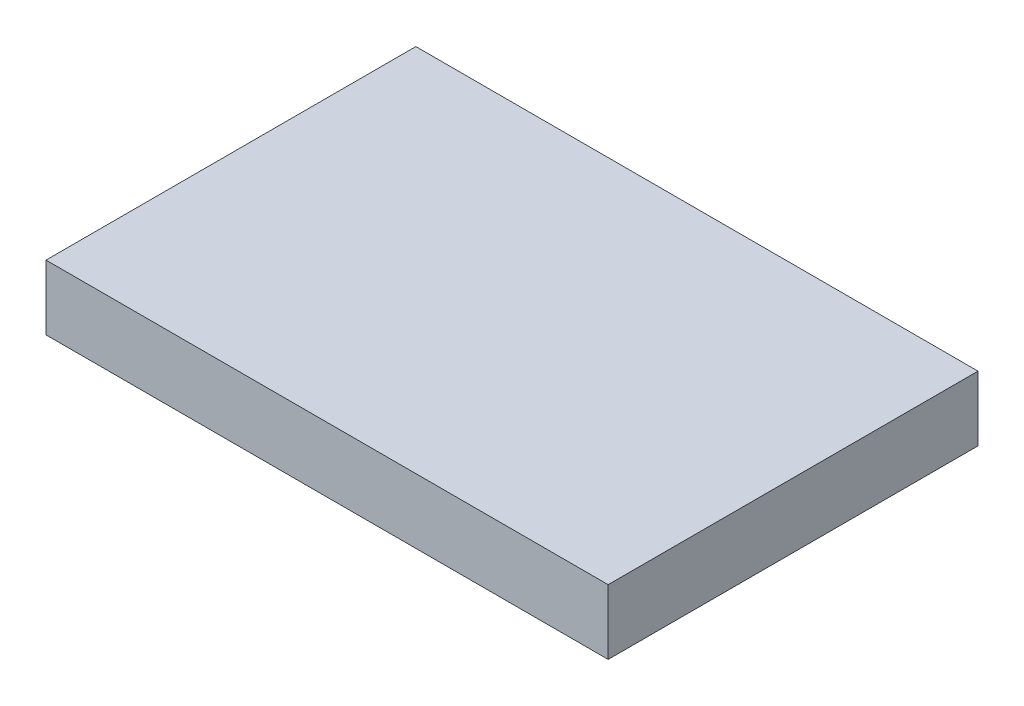
ISO-10303-21;
HEADER;
FILE_DESCRIPTION(('STEP AP214'),'2;1');
FILE_NAME('part.step','',(''),(''),'','','');
FILE_SCHEMA(('AUTOMOTIVE_DESIGN { 1 0 10303 214 1 1 1 1 }'));
ENDSEC;
DATA;
#1=APPLICATION_CONTEXT('core data for automotive mechanical design processes');
#2=APPLICATION_PROTOCOL_DEFINITION('international standard','automotive_design',2000,#1);
#3=PRODUCT_CONTEXT('',#1,'mechanical');
#4=PRODUCT('Part','Part','',(#3));
#5=PRODUCT_RELATED_PRODUCT_CATEGORY('part','',(#4));
#6=PRODUCT_DEFINITION_FORMATION('','',#4);
#7=PRODUCT_DEFINITION_CONTEXT('part definition',#1,'design');
#8=PRODUCT_DEFINITION('design','',#6,#7);
#9=PRODUCT_DEFINITION_SHAPE('','',#8);
#10=(LENGTH_UNIT() NAMED_UNIT(*) SI_UNIT(.MILLI.,.METRE.));
#11=(NAMED_UNIT(*) PLANE_ANGLE_UNIT() SI_UNIT($,.RADIAN.));
#12=(NAMED_UNIT(*) SI_UNIT($,.STERADIAN.) SOLID_ANGLE_UNIT());
#13=UNCERTAINTY_MEASURE_WITH_UNIT(LENGTH_MEASURE(1.E-05),#10,'distance_accuracy_value','');
#14=(GEOMETRIC_REPRESENTATION_CONTEXT(3) GLOBAL_UNCERTAINTY_ASSIGNED_CONTEXT((#13)) GLOBAL_UNIT_ASSIGNED_CONTEXT((#10,
#11,#12)) REPRESENTATION_CONTEXT('',''));
#15=CARTESIAN_POINT('',(0.,0.,0.));
#16=DIRECTION('',(0.,0.,1.));
#17=DIRECTION('',(1.,0.,0.));
#18=AXIS2_PLACEMENT_3D('',#15,#16,#17);
#19=CARTESIAN_POINT('',(0.,9.5,0.));
#20=DIRECTION('',(1.,0.,0.));
#21=DIRECTION('',(0.,0.,-1.));
#22=AXIS2_PLACEMENT_3D('',#19,#20,#21);
#23=PLANE('',#22);
#24=DIRECTION('',(0.,0.,1.));
#25=VECTOR('',#24,1.);
#26=CARTESIAN_POINT('',(0.,0.,0.));
#27=LINE('',#26,#25);
#28=CARTESIAN_POINT('',(0.,0.,0.));
#29=VERTEX_POINT('',#28);
#30=CARTESIAN_POINT('',(0.,0.,54.25));
#31=VERTEX_POINT('',#30);
#32=EDGE_CURVE('E100',#29,#31,#27,.T.);
#33=ORIENTED_EDGE('',*,*,#32,.T.);
#34=DIRECTION('',(0.,-1.,0.));
#35=VECTOR('',#34,1.);
#36=CARTESIAN_POINT('',(0.,9.5,54.25));
#37=LINE('',#36,#35);
#38=CARTESIAN_POINT('',(0.,9.5,54.25));
#39=VERTEX_POINT('',#38);
#40=EDGE_CURVE('E11',#39,#31,#37,.T.);
#41=ORIENTED_EDGE('',*,*,#40,.F.);
#42=DIRECTION('',(0.,0.,1.));
#43=VECTOR('',#42,1.);
#44=CARTESIAN_POINT('',(0.,9.5,0.));
#45=LINE('',#44,#43);
#46=CARTESIAN_POINT('',(0.,9.5,0.));
#47=VERTEX_POINT('',#46);
#48=EDGE_CURVE('E88',#47,#39,#45,.T.);
#49=ORIENTED_EDGE('',*,*,#48,.F.);
#50=DIRECTION('',(0.,-1.,0.));
#51=VECTOR('',#50,1.);
#52=CARTESIAN_POINT('',(0.,9.5,0.));
#53=LINE('',#52,#51);
#54=EDGE_CURVE('E96',#47,#29,#53,.T.);
#55=ORIENTED_EDGE('',*,*,#54,.T.);
#56=EDGE_LOOP('',(#33,#41,#49,#55));
#57=FACE_BOUND('',#56,.T.);
#58=ADVANCED_FACE('F37',(#57),#23,.F.);
#59=CARTESIAN_POINT('',(0.,9.5,54.25));
#60=DIRECTION('',(0.,0.,-1.));
#61=DIRECTION('',(-1.,0.,0.));
#62=AXIS2_PLACEMENT_3D('',#59,#60,#61);
#63=PLANE('',#62);
#64=DIRECTION('',(1.,0.,0.));
#65=VECTOR('',#64,1.);
#66=CARTESIAN_POINT('',(0.,0.,54.25));
#67=LINE('',#66,#65);
#68=CARTESIAN_POINT('',(82.46,0.,54.25));
#69=VERTEX_POINT('',#68);
#70=EDGE_CURVE('E92',#31,#69,#67,.T.);
#71=ORIENTED_EDGE('',*,*,#70,.T.);
#72=DIRECTION('',(0.,-1.,0.));
#73=VECTOR('',#72,1.);
#74=CARTESIAN_POINT('',(82.46,9.5,54.25));
#75=LINE('',#74,#73);
#76=CARTESIAN_POINT('',(82.46,9.5,54.25));
#77=VERTEX_POINT('',#76);
#78=EDGE_CURVE('E45',#77,#69,#75,.T.);
#79=ORIENTED_EDGE('',*,*,#78,.F.);
#80=DIRECTION('',(1.,0.,0.));
#81=VECTOR('',#80,1.);
#82=CARTESIAN_POINT('',(0.,9.5,54.25));
#83=LINE('',#82,#81);
#84=EDGE_CURVE('E83',#39,#77,#83,.T.);
#85=ORIENTED_EDGE('',*,*,#84,.F.);
#86=ORIENTED_EDGE('',*,*,#40,.T.);
#87=EDGE_LOOP('',(#71,#79,#85,#86));
#88=FACE_BOUND('',#87,.T.);
#89=ADVANCED_FACE('F91',(#88),#63,.F.);
#90=CARTESIAN_POINT('',(82.46,9.5,0.));
#91=DIRECTION('',(-1.,0.,0.));
#92=DIRECTION('',(0.,0.,1.));
#93=AXIS2_PLACEMENT_3D('',#90,#91,#92);
#94=PLANE('',#93);
#95=DIRECTION('',(0.,0.,-1.));
#96=VECTOR('',#95,1.);
#97=CARTESIAN_POINT('',(82.46,0.,0.));
#98=LINE('',#97,#96);
#99=CARTESIAN_POINT('',(82.46,0.,0.));
#100=VERTEX_POINT('',#99);
#101=EDGE_CURVE('E70',#69,#100,#98,.T.);
#102=ORIENTED_EDGE('',*,*,#101,.T.);
#103=DIRECTION('',(0.,-1.,0.));
#104=VECTOR('',#103,1.);
#105=CARTESIAN_POINT('',(82.46,9.5,0.));
#106=LINE('',#105,#104);
#107=CARTESIAN_POINT('',(82.46,9.5,0.));
#108=VERTEX_POINT('',#107);
#109=EDGE_CURVE('E93',#108,#100,#106,.T.);
#110=ORIENTED_EDGE('',*,*,#109,.F.);
#111=DIRECTION('',(0.,0.,-1.));
#112=VECTOR('',#111,1.);
#113=CARTESIAN_POINT('',(82.46,9.5,0.));
#114=LINE('',#113,#112);
#115=EDGE_CURVE('E86',#77,#108,#114,.T.);
#116=ORIENTED_EDGE('',*,*,#115,.F.);
#117=ORIENTED_EDGE('',*,*,#78,.T.);
#118=EDGE_LOOP('',(#102,#110,#116,#117));
#119=FACE_BOUND('',#118,.T.);
#120=ADVANCED_FACE('F94',(#119),#94,.F.);
#121=CARTESIAN_POINT('',(0.,9.5,0.));
#122=DIRECTION('',(0.,0.,1.));
#123=DIRECTION('',(1.,0.,0.));
#124=AXIS2_PLACEMENT_3D('',#121,#122,#123);
#125=PLANE('',#124);
#126=DIRECTION('',(-1.,0.,0.));
#127=VECTOR('',#126,1.);
#128=CARTESIAN_POINT('',(0.,0.,0.));
#129=LINE('',#128,#127);
#130=EDGE_CURVE('E76',#100,#29,#129,.T.);
#131=ORIENTED_EDGE('',*,*,#130,.T.);
#132=ORIENTED_EDGE('',*,*,#54,.F.);
#133=DIRECTION('',(-1.,0.,0.));
#134=VECTOR('',#133,1.);
#135=CARTESIAN_POINT('',(0.,9.5,0.));
#136=LINE('',#135,#134);
#137=EDGE_CURVE('E53',#108,#47,#136,.T.);
#138=ORIENTED_EDGE('',*,*,#137,.F.);
#139=ORIENTED_EDGE('',*,*,#109,.T.);
#140=EDGE_LOOP('',(#131,#132,#138,#139));
#141=FACE_BOUND('',#140,.T.);
#142=ADVANCED_FACE('F107',(#141),#125,.F.);
#143=CARTESIAN_POINT('',(0.,9.5,0.));
#144=DIRECTION('',(0.,1.,0.));
#145=DIRECTION('',(0.,0.,1.));
#146=AXIS2_PLACEMENT_3D('',#143,#144,#145);
#147=PLANE('',#146);
#148=ORIENTED_EDGE('',*,*,#48,.T.);
#149=ORIENTED_EDGE('',*,*,#84,.T.);
#150=ORIENTED_EDGE('',*,*,#115,.T.);
#151=ORIENTED_EDGE('',*,*,#137,.T.);
#152=EDGE_LOOP('',(#148,#149,#150,#151));
#153=FACE_BOUND('',#152,.T.);
#154=ADVANCED_FACE('F84',(#153),#147,.T.);
#155=CARTESIAN_POINT('',(0.,0.,0.));
#156=DIRECTION('',(0.,1.,0.));
#157=DIRECTION('',(0.,0.,1.));
#158=AXIS2_PLACEMENT_3D('',#155,#156,#157);
#159=PLANE('',#158);
#160=ORIENTED_EDGE('',*,*,#32,.F.);
#161=ORIENTED_EDGE('',*,*,#130,.F.);
#162=ORIENTED_EDGE('',*,*,#101,.F.);
#163=ORIENTED_EDGE('',*,*,#70,.F.);
#164=EDGE_LOOP('',(#160,#161,#162,#163));
#165=FACE_BOUND('',#164,.T.);
#166=ADVANCED_FACE('F110',(#165),#159,.F.);
#167=CLOSED_SHELL('',(#58,#89,#120,#142,#154,#166));
#168=MANIFOLD_SOLID_BREP('B2',#167);
#169=ADVANCED_BREP_SHAPE_REPRESENTATION('',(#18,#168),#14);
#170=SHAPE_DEFINITION_REPRESENTATION(#9,#169);
ENDSEC;
END-ISO-10303-21;
